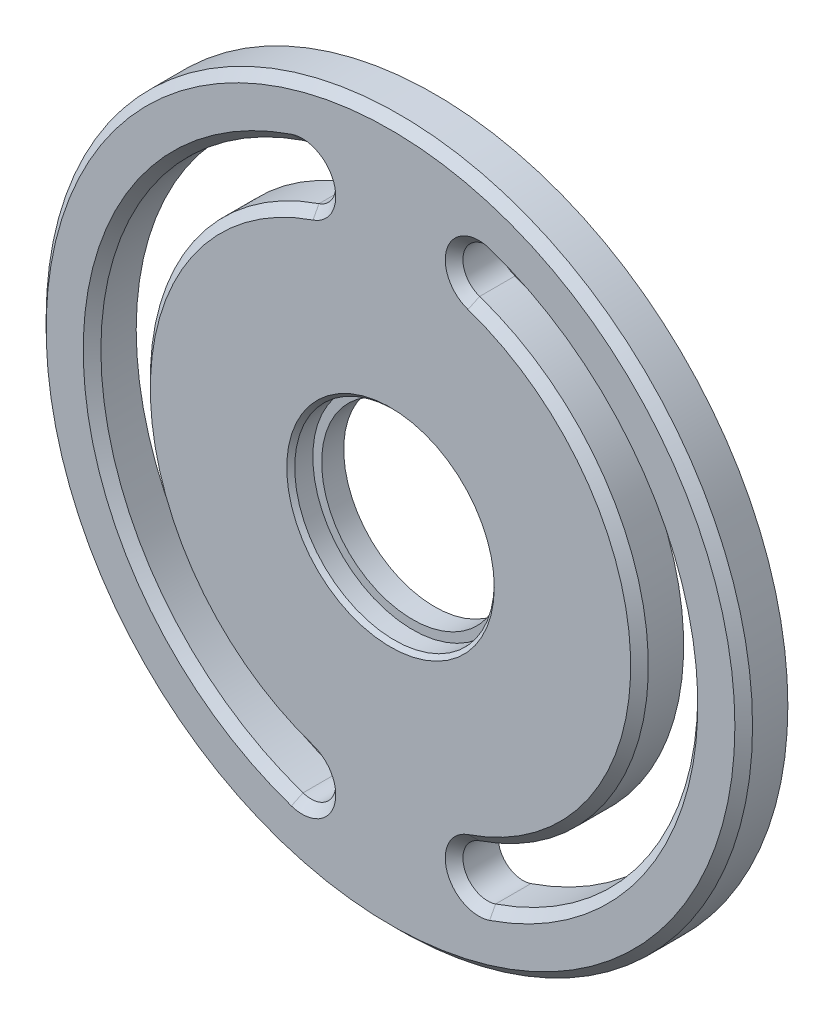
ISO-10303-21;
HEADER;
FILE_DESCRIPTION(('STEP AP214'),'2;1');
FILE_NAME('part.step','',(''),(''),'','','');
FILE_SCHEMA(('AUTOMOTIVE_DESIGN { 1 0 10303 214 1 1 1 1 }'));
ENDSEC;
DATA;
#1=APPLICATION_CONTEXT('core data for automotive mechanical design processes');
#2=APPLICATION_PROTOCOL_DEFINITION('international standard','automotive_design',2000,#1);
#3=PRODUCT_CONTEXT('',#1,'mechanical');
#4=PRODUCT('Part','Part','',(#3));
#5=PRODUCT_RELATED_PRODUCT_CATEGORY('part','',(#4));
#6=PRODUCT_DEFINITION_FORMATION('','',#4);
#7=PRODUCT_DEFINITION_CONTEXT('part definition',#1,'design');
#8=PRODUCT_DEFINITION('design','',#6,#7);
#9=PRODUCT_DEFINITION_SHAPE('','',#8);
#10=(LENGTH_UNIT() NAMED_UNIT(*) SI_UNIT(.MILLI.,.METRE.));
#11=(NAMED_UNIT(*) PLANE_ANGLE_UNIT() SI_UNIT($,.RADIAN.));
#12=(NAMED_UNIT(*) SI_UNIT($,.STERADIAN.) SOLID_ANGLE_UNIT());
#13=UNCERTAINTY_MEASURE_WITH_UNIT(LENGTH_MEASURE(1.E-05),#10,'distance_accuracy_value','');
#14=(GEOMETRIC_REPRESENTATION_CONTEXT(3) GLOBAL_UNCERTAINTY_ASSIGNED_CONTEXT((#13)) GLOBAL_UNIT_ASSIGNED_CONTEXT((#10,
#11,#12)) REPRESENTATION_CONTEXT('',''));
#15=CARTESIAN_POINT('',(0.,0.,0.));
#16=DIRECTION('',(0.,0.,1.));
#17=DIRECTION('',(1.,0.,0.));
#18=AXIS2_PLACEMENT_3D('',#15,#16,#17);
#19=CARTESIAN_POINT('',(0.,0.,6.35));
#20=DIRECTION('',(0.,0.,1.));
#21=DIRECTION('',(1.,0.,0.));
#22=AXIS2_PLACEMENT_3D('',#19,#20,#21);
#23=PLANE('',#22);
#24=CARTESIAN_POINT('',(0.,0.,6.35));
#25=DIRECTION('',(0.,0.,1.));
#26=DIRECTION('',(1.,0.,0.));
#27=AXIS2_PLACEMENT_3D('',#24,#25,#26);
#28=CIRCLE('',#27,14.9225);
#29=CARTESIAN_POINT('',(14.9225,0.,6.35));
#30=VERTEX_POINT('',#29);
#31=EDGE_CURVE('E585',#30,#30,#28,.T.);
#32=ORIENTED_EDGE('',*,*,#31,.F.);
#33=EDGE_LOOP('',(#32));
#34=FACE_BOUND('',#33,.T.);
#35=CARTESIAN_POINT('',(0.,0.,6.35));
#36=DIRECTION('',(0.,0.,1.));
#37=DIRECTION('',(1.,0.,0.));
#38=AXIS2_PLACEMENT_3D('',#35,#36,#37);
#39=CIRCLE('',#38,44.196);
#40=CARTESIAN_POINT('',(14.2567741935484,41.8333695223583,6.35));
#41=VERTEX_POINT('',#40);
#42=CARTESIAN_POINT('',(14.2567741935484,-41.8333695223583,6.35));
#43=VERTEX_POINT('',#42);
#44=EDGE_CURVE('E219',#41,#43,#39,.F.);
#45=ORIENTED_EDGE('',*,*,#44,.T.);
#46=CARTESIAN_POINT('',(12.7,-37.2653579078479,6.35));
#47=DIRECTION('',(0.,0.,1.));
#48=DIRECTION('',(1.,0.,0.));
#49=AXIS2_PLACEMENT_3D('',#46,#47,#48);
#50=CIRCLE('',#49,4.82600000000001);
#51=CARTESIAN_POINT('',(11.1432258064516,-32.6973462933375,6.35));
#52=VERTEX_POINT('',#51);
#53=EDGE_CURVE('E221',#43,#52,#50,.F.);
#54=ORIENTED_EDGE('',*,*,#53,.T.);
#55=CARTESIAN_POINT('',(0.,0.,6.35));
#56=DIRECTION('',(0.,0.,1.));
#57=DIRECTION('',(1.,0.,0.));
#58=AXIS2_PLACEMENT_3D('',#55,#56,#57);
#59=CIRCLE('',#58,34.544);
#60=CARTESIAN_POINT('',(11.1432258064516,32.6973462933375,6.35));
#61=VERTEX_POINT('',#60);
#62=EDGE_CURVE('E215',#52,#61,#59,.T.);
#63=ORIENTED_EDGE('',*,*,#62,.T.);
#64=CARTESIAN_POINT('',(12.7,37.2653579078479,6.35));
#65=DIRECTION('',(0.,0.,1.));
#66=DIRECTION('',(1.,0.,0.));
#67=AXIS2_PLACEMENT_3D('',#64,#65,#66);
#68=CIRCLE('',#67,4.82600000000001);
#69=EDGE_CURVE('E217',#61,#41,#68,.F.);
#70=ORIENTED_EDGE('',*,*,#69,.T.);
#71=EDGE_LOOP('',(#45,#54,#63,#70));
#72=FACE_BOUND('',#71,.T.);
#73=CARTESIAN_POINT('',(0.,0.,6.35));
#74=DIRECTION('',(0.,0.,1.));
#75=DIRECTION('',(1.,0.,0.));
#76=AXIS2_PLACEMENT_3D('',#73,#74,#75);
#77=CIRCLE('',#76,34.544);
#78=CARTESIAN_POINT('',(-11.1432258064516,32.6973462933375,6.35));
#79=VERTEX_POINT('',#78);
#80=CARTESIAN_POINT('',(-11.1432258064516,-32.6973462933375,6.35));
#81=VERTEX_POINT('',#80);
#82=EDGE_CURVE('E210',#79,#81,#77,.T.);
#83=ORIENTED_EDGE('',*,*,#82,.T.);
#84=CARTESIAN_POINT('',(-12.7,-37.2653579078479,6.35));
#85=DIRECTION('',(0.,0.,1.));
#86=DIRECTION('',(1.,0.,0.));
#87=AXIS2_PLACEMENT_3D('',#84,#85,#86);
#88=CIRCLE('',#87,4.82600000000003);
#89=CARTESIAN_POINT('',(-14.2567741935484,-41.8333695223583,6.35));
#90=VERTEX_POINT('',#89);
#91=EDGE_CURVE('E212',#81,#90,#88,.F.);
#92=ORIENTED_EDGE('',*,*,#91,.T.);
#93=CARTESIAN_POINT('',(0.,0.,6.35));
#94=DIRECTION('',(0.,0.,1.));
#95=DIRECTION('',(1.,0.,0.));
#96=AXIS2_PLACEMENT_3D('',#93,#94,#95);
#97=CIRCLE('',#96,44.196);
#98=CARTESIAN_POINT('',(-14.2567741935484,41.8333695223583,6.35));
#99=VERTEX_POINT('',#98);
#100=EDGE_CURVE('E206',#90,#99,#97,.F.);
#101=ORIENTED_EDGE('',*,*,#100,.T.);
#102=CARTESIAN_POINT('',(-12.7,37.2653579078479,6.35));
#103=DIRECTION('',(0.,0.,1.));
#104=DIRECTION('',(1.,0.,0.));
#105=AXIS2_PLACEMENT_3D('',#102,#103,#104);
#106=CIRCLE('',#105,4.82600000000002);
#107=EDGE_CURVE('E208',#99,#79,#106,.F.);
#108=ORIENTED_EDGE('',*,*,#107,.T.);
#109=EDGE_LOOP('',(#83,#92,#101,#108));
#110=FACE_BOUND('',#109,.T.);
#111=CARTESIAN_POINT('',(0.,0.,6.35));
#112=DIRECTION('',(0.,0.,1.));
#113=DIRECTION('',(1.,0.,0.));
#114=AXIS2_PLACEMENT_3D('',#111,#112,#113);
#115=CIRCLE('',#114,49.53);
#116=CARTESIAN_POINT('',(49.53,0.,6.35));
#117=VERTEX_POINT('',#116);
#118=EDGE_CURVE('E203',#117,#117,#115,.T.);
#119=ORIENTED_EDGE('',*,*,#118,.T.);
#120=EDGE_LOOP('',(#119));
#121=FACE_BOUND('',#120,.T.);
#122=ADVANCED_FACE('F43',(#34,#72,#110,#121),#23,.T.);
#123=CARTESIAN_POINT('',(0.,0.,0.));
#124=DIRECTION('',(0.,0.,1.));
#125=DIRECTION('',(1.,0.,0.));
#126=AXIS2_PLACEMENT_3D('',#123,#124,#125);
#127=PLANE('',#126);
#128=CARTESIAN_POINT('',(0.,0.,0.));
#129=DIRECTION('',(0.,0.,1.));
#130=DIRECTION('',(1.,0.,0.));
#131=AXIS2_PLACEMENT_3D('',#128,#129,#130);
#132=CIRCLE('',#131,13.081);
#133=CARTESIAN_POINT('',(13.081,0.,0.));
#134=VERTEX_POINT('',#133);
#135=EDGE_CURVE('E168',#134,#134,#132,.T.);
#136=ORIENTED_EDGE('',*,*,#135,.T.);
#137=EDGE_LOOP('',(#136));
#138=FACE_BOUND('',#137,.T.);
#139=CARTESIAN_POINT('',(-12.7,37.2653579078479,0.));
#140=DIRECTION('',(0.,0.,1.));
#141=DIRECTION('',(1.,0.,0.));
#142=AXIS2_PLACEMENT_3D('',#139,#140,#141);
#143=CIRCLE('',#142,3.556);
#144=CARTESIAN_POINT('',(-11.5529032258064,33.8994546129455,0.));
#145=VERTEX_POINT('',#144);
#146=CARTESIAN_POINT('',(-13.8470967741935,40.6312612027503,0.));
#147=VERTEX_POINT('',#146);
#148=EDGE_CURVE('E147',#145,#147,#143,.T.);
#149=ORIENTED_EDGE('',*,*,#148,.T.);
#150=CARTESIAN_POINT('',(0.,0.,0.));
#151=DIRECTION('',(0.,0.,1.));
#152=DIRECTION('',(1.,0.,0.));
#153=AXIS2_PLACEMENT_3D('',#150,#151,#152);
#154=CIRCLE('',#153,42.926);
#155=CARTESIAN_POINT('',(-13.8470967741936,-40.6312612027503,0.));
#156=VERTEX_POINT('',#155);
#157=EDGE_CURVE('E180',#147,#156,#154,.T.);
#158=ORIENTED_EDGE('',*,*,#157,.T.);
#159=CARTESIAN_POINT('',(-12.7,-37.2653579078479,0.));
#160=DIRECTION('',(0.,0.,1.));
#161=DIRECTION('',(1.,0.,0.));
#162=AXIS2_PLACEMENT_3D('',#159,#160,#161);
#163=CIRCLE('',#162,3.556);
#164=CARTESIAN_POINT('',(-11.5529032258064,-33.8994546129455,0.));
#165=VERTEX_POINT('',#164);
#166=EDGE_CURVE('E183',#156,#165,#163,.T.);
#167=ORIENTED_EDGE('',*,*,#166,.T.);
#168=CARTESIAN_POINT('',(0.,0.,0.));
#169=DIRECTION('',(0.,0.,-1.));
#170=DIRECTION('',(1.,0.,0.));
#171=AXIS2_PLACEMENT_3D('',#168,#169,#170);
#172=CIRCLE('',#171,35.814);
#173=EDGE_CURVE('E186',#165,#145,#172,.T.);
#174=ORIENTED_EDGE('',*,*,#173,.T.);
#175=EDGE_LOOP('',(#149,#158,#167,#174));
#176=FACE_BOUND('',#175,.T.);
#177=CARTESIAN_POINT('',(0.,0.,0.));
#178=DIRECTION('',(0.,0.,1.));
#179=DIRECTION('',(1.,0.,0.));
#180=AXIS2_PLACEMENT_3D('',#177,#178,#179);
#181=CIRCLE('',#180,50.8);
#182=CARTESIAN_POINT('',(50.8,0.,0.));
#183=VERTEX_POINT('',#182);
#184=EDGE_CURVE('E197',#183,#183,#181,.T.);
#185=ORIENTED_EDGE('',*,*,#184,.F.);
#186=EDGE_LOOP('',(#185));
#187=FACE_BOUND('',#186,.T.);
#188=CARTESIAN_POINT('',(12.7,37.2653579078479,0.));
#189=DIRECTION('',(0.,0.,1.));
#190=DIRECTION('',(-1.,0.,0.));
#191=AXIS2_PLACEMENT_3D('',#188,#189,#190);
#192=CIRCLE('',#191,3.556);
#193=CARTESIAN_POINT('',(13.8470967741935,40.6312612027503,0.));
#194=VERTEX_POINT('',#193);
#195=CARTESIAN_POINT('',(11.5529032258064,33.8994546129455,0.));
#196=VERTEX_POINT('',#195);
#197=EDGE_CURVE('E141',#194,#196,#192,.T.);
#198=ORIENTED_EDGE('',*,*,#197,.T.);
#199=CARTESIAN_POINT('',(0.,0.,0.));
#200=DIRECTION('',(0.,0.,-1.));
#201=DIRECTION('',(-1.,0.,0.));
#202=AXIS2_PLACEMENT_3D('',#199,#200,#201);
#203=CIRCLE('',#202,35.814);
#204=CARTESIAN_POINT('',(11.5529032258064,-33.8994546129455,0.));
#205=VERTEX_POINT('',#204);
#206=EDGE_CURVE('E151',#196,#205,#203,.T.);
#207=ORIENTED_EDGE('',*,*,#206,.T.);
#208=CARTESIAN_POINT('',(12.7,-37.2653579078479,0.));
#209=DIRECTION('',(0.,0.,1.));
#210=DIRECTION('',(-1.,0.,0.));
#211=AXIS2_PLACEMENT_3D('',#208,#209,#210);
#212=CIRCLE('',#211,3.556);
#213=CARTESIAN_POINT('',(13.8470967741936,-40.6312612027503,0.));
#214=VERTEX_POINT('',#213);
#215=EDGE_CURVE('E157',#205,#214,#212,.T.);
#216=ORIENTED_EDGE('',*,*,#215,.T.);
#217=CARTESIAN_POINT('',(0.,0.,0.));
#218=DIRECTION('',(0.,0.,1.));
#219=DIRECTION('',(-1.,0.,0.));
#220=AXIS2_PLACEMENT_3D('',#217,#218,#219);
#221=CIRCLE('',#220,42.926);
#222=EDGE_CURVE('E161',#214,#194,#221,.T.);
#223=ORIENTED_EDGE('',*,*,#222,.T.);
#224=EDGE_LOOP('',(#198,#207,#216,#223));
#225=FACE_BOUND('',#224,.T.);
#226=ADVANCED_FACE('F159',(#138,#176,#187,#225),#127,.F.);
#227=CARTESIAN_POINT('',(0.,0.,6.35));
#228=DIRECTION('',(0.,0.,-1.));
#229=DIRECTION('',(-1.,0.,0.));
#230=AXIS2_PLACEMENT_3D('',#227,#228,#229);
#231=CYLINDRICAL_SURFACE('',#230,50.8);
#232=CARTESIAN_POINT('',(0.,0.,5.07999999999999));
#233=DIRECTION('',(0.,0.,1.));
#234=DIRECTION('',(1.,0.,0.));
#235=AXIS2_PLACEMENT_3D('',#232,#233,#234);
#236=CIRCLE('',#235,50.8);
#237=CARTESIAN_POINT('',(50.8,0.,5.07999999999999));
#238=VERTEX_POINT('',#237);
#239=EDGE_CURVE('E11',#238,#238,#236,.F.);
#240=ORIENTED_EDGE('',*,*,#239,.T.);
#241=EDGE_LOOP('',(#240));
#242=FACE_BOUND('',#241,.T.);
#243=ORIENTED_EDGE('',*,*,#184,.T.);
#244=EDGE_LOOP('',(#243));
#245=FACE_BOUND('',#244,.T.);
#246=ADVANCED_FACE('F281',(#242,#245),#231,.T.);
#247=CARTESIAN_POINT('',(-12.7,37.2653579078479,6.35));
#248=DIRECTION('',(0.,0.,-1.));
#249=DIRECTION('',(-1.,0.,0.));
#250=AXIS2_PLACEMENT_3D('',#247,#248,#249);
#251=CYLINDRICAL_SURFACE('',#250,3.556);
#252=DIRECTION('',(0.,0.,-1.));
#253=VECTOR('',#252,1.);
#254=CARTESIAN_POINT('',(-11.5529032258064,33.8994546129455,6.35));
#255=LINE('',#254,#253);
#256=CARTESIAN_POINT('',(-11.5529032258064,33.8994546129455,5.08000000000001));
#257=VERTEX_POINT('',#256);
#258=EDGE_CURVE('E189',#257,#145,#255,.T.);
#259=ORIENTED_EDGE('',*,*,#258,.F.);
#260=CARTESIAN_POINT('',(-12.7,37.2653579078479,5.08000000000001));
#261=DIRECTION('',(0.,0.,1.));
#262=DIRECTION('',(1.,0.,0.));
#263=AXIS2_PLACEMENT_3D('',#260,#261,#262);
#264=CIRCLE('',#263,3.556);
#265=CARTESIAN_POINT('',(-13.8470967741935,40.6312612027503,5.08000000000001));
#266=VERTEX_POINT('',#265);
#267=EDGE_CURVE('E61',#257,#266,#264,.T.);
#268=ORIENTED_EDGE('',*,*,#267,.T.);
#269=DIRECTION('',(0.,0.,-1.));
#270=VECTOR('',#269,1.);
#271=CARTESIAN_POINT('',(-13.8470967741935,40.6312612027503,6.35));
#272=LINE('',#271,#270);
#273=EDGE_CURVE('E195',#266,#147,#272,.T.);
#274=ORIENTED_EDGE('',*,*,#273,.T.);
#275=ORIENTED_EDGE('',*,*,#148,.F.);
#276=EDGE_LOOP('',(#259,#268,#274,#275));
#277=FACE_BOUND('',#276,.T.);
#278=ADVANCED_FACE('F279',(#277),#251,.F.);
#279=CARTESIAN_POINT('',(0.,0.,6.35));
#280=DIRECTION('',(0.,0.,-1.));
#281=DIRECTION('',(-1.,0.,0.));
#282=AXIS2_PLACEMENT_3D('',#279,#280,#281);
#283=CYLINDRICAL_SURFACE('',#282,42.926);
#284=ORIENTED_EDGE('',*,*,#273,.F.);
#285=CARTESIAN_POINT('',(0.,0.,5.08000000000001));
#286=DIRECTION('',(0.,0.,1.));
#287=DIRECTION('',(1.,0.,0.));
#288=AXIS2_PLACEMENT_3D('',#285,#286,#287);
#289=CIRCLE('',#288,42.926);
#290=CARTESIAN_POINT('',(-13.8470967741936,-40.6312612027503,5.08000000000001));
#291=VERTEX_POINT('',#290);
#292=EDGE_CURVE('E53',#266,#291,#289,.T.);
#293=ORIENTED_EDGE('',*,*,#292,.T.);
#294=DIRECTION('',(0.,0.,-1.));
#295=VECTOR('',#294,1.);
#296=CARTESIAN_POINT('',(-13.8470967741936,-40.6312612027503,6.35));
#297=LINE('',#296,#295);
#298=EDGE_CURVE('E193',#291,#156,#297,.T.);
#299=ORIENTED_EDGE('',*,*,#298,.T.);
#300=ORIENTED_EDGE('',*,*,#157,.F.);
#301=EDGE_LOOP('',(#284,#293,#299,#300));
#302=FACE_BOUND('',#301,.T.);
#303=ADVANCED_FACE('F278',(#302),#283,.F.);
#304=CARTESIAN_POINT('',(-12.7,-37.2653579078479,6.35));
#305=DIRECTION('',(0.,0.,-1.));
#306=DIRECTION('',(-1.,0.,0.));
#307=AXIS2_PLACEMENT_3D('',#304,#305,#306);
#308=CYLINDRICAL_SURFACE('',#307,3.556);
#309=ORIENTED_EDGE('',*,*,#298,.F.);
#310=CARTESIAN_POINT('',(-12.7,-37.2653579078479,5.08000000000001));
#311=DIRECTION('',(0.,0.,1.));
#312=DIRECTION('',(1.,0.,0.));
#313=AXIS2_PLACEMENT_3D('',#310,#311,#312);
#314=CIRCLE('',#313,3.556);
#315=CARTESIAN_POINT('',(-11.5529032258064,-33.8994546129455,5.08000000000001));
#316=VERTEX_POINT('',#315);
#317=EDGE_CURVE('E229',#291,#316,#314,.T.);
#318=ORIENTED_EDGE('',*,*,#317,.T.);
#319=DIRECTION('',(0.,0.,-1.));
#320=VECTOR('',#319,1.);
#321=CARTESIAN_POINT('',(-11.5529032258064,-33.8994546129455,6.35));
#322=LINE('',#321,#320);
#323=EDGE_CURVE('E191',#316,#165,#322,.T.);
#324=ORIENTED_EDGE('',*,*,#323,.T.);
#325=ORIENTED_EDGE('',*,*,#166,.F.);
#326=EDGE_LOOP('',(#309,#318,#324,#325));
#327=FACE_BOUND('',#326,.T.);
#328=ADVANCED_FACE('F269',(#327),#308,.F.);
#329=CARTESIAN_POINT('',(0.,0.,6.35));
#330=DIRECTION('',(0.,0.,-1.));
#331=DIRECTION('',(-1.,0.,0.));
#332=AXIS2_PLACEMENT_3D('',#329,#330,#331);
#333=CYLINDRICAL_SURFACE('',#332,35.814);
#334=ORIENTED_EDGE('',*,*,#323,.F.);
#335=CARTESIAN_POINT('',(0.,0.,5.08000000000001));
#336=DIRECTION('',(0.,0.,1.));
#337=DIRECTION('',(1.,0.,0.));
#338=AXIS2_PLACEMENT_3D('',#335,#336,#337);
#339=CIRCLE('',#338,35.814);
#340=EDGE_CURVE('E69',#316,#257,#339,.F.);
#341=ORIENTED_EDGE('',*,*,#340,.T.);
#342=ORIENTED_EDGE('',*,*,#258,.T.);
#343=ORIENTED_EDGE('',*,*,#173,.F.);
#344=EDGE_LOOP('',(#334,#341,#342,#343));
#345=FACE_BOUND('',#344,.T.);
#346=ADVANCED_FACE('F272',(#345),#333,.T.);
#347=CARTESIAN_POINT('',(12.7,37.2653579078479,6.35));
#348=DIRECTION('',(0.,0.,-1.));
#349=DIRECTION('',(-1.,0.,0.));
#350=AXIS2_PLACEMENT_3D('',#347,#348,#349);
#351=CYLINDRICAL_SURFACE('',#350,3.556);
#352=DIRECTION('',(0.,0.,-1.));
#353=VECTOR('',#352,1.);
#354=CARTESIAN_POINT('',(13.8470967741935,40.6312612027503,6.35));
#355=LINE('',#354,#353);
#356=CARTESIAN_POINT('',(13.8470967741935,40.6312612027503,5.08));
#357=VERTEX_POINT('',#356);
#358=EDGE_CURVE('E173',#357,#194,#355,.T.);
#359=ORIENTED_EDGE('',*,*,#358,.F.);
#360=CARTESIAN_POINT('',(12.7,37.2653579078479,5.08));
#361=DIRECTION('',(0.,0.,1.));
#362=DIRECTION('',(1.,0.,0.));
#363=AXIS2_PLACEMENT_3D('',#360,#361,#362);
#364=CIRCLE('',#363,3.556);
#365=CARTESIAN_POINT('',(11.5529032258064,33.8994546129455,5.08));
#366=VERTEX_POINT('',#365);
#367=EDGE_CURVE('E144',#357,#366,#364,.T.);
#368=ORIENTED_EDGE('',*,*,#367,.T.);
#369=DIRECTION('',(0.,0.,-1.));
#370=VECTOR('',#369,1.);
#371=CARTESIAN_POINT('',(11.5529032258064,33.8994546129455,6.35));
#372=LINE('',#371,#370);
#373=EDGE_CURVE('E136',#366,#196,#372,.T.);
#374=ORIENTED_EDGE('',*,*,#373,.T.);
#375=ORIENTED_EDGE('',*,*,#197,.F.);
#376=EDGE_LOOP('',(#359,#368,#374,#375));
#377=FACE_BOUND('',#376,.T.);
#378=ADVANCED_FACE('F139',(#377),#351,.F.);
#379=CARTESIAN_POINT('',(0.,0.,6.35));
#380=DIRECTION('',(0.,0.,-1.));
#381=DIRECTION('',(-1.,0.,0.));
#382=AXIS2_PLACEMENT_3D('',#379,#380,#381);
#383=CYLINDRICAL_SURFACE('',#382,35.814);
#384=ORIENTED_EDGE('',*,*,#373,.F.);
#385=CARTESIAN_POINT('',(0.,0.,5.08));
#386=DIRECTION('',(0.,0.,1.));
#387=DIRECTION('',(1.,0.,0.));
#388=AXIS2_PLACEMENT_3D('',#385,#386,#387);
#389=CIRCLE('',#388,35.814);
#390=CARTESIAN_POINT('',(11.5529032258064,-33.8994546129455,5.08));
#391=VERTEX_POINT('',#390);
#392=EDGE_CURVE('E227',#366,#391,#389,.F.);
#393=ORIENTED_EDGE('',*,*,#392,.T.);
#394=DIRECTION('',(0.,0.,-1.));
#395=VECTOR('',#394,1.);
#396=CARTESIAN_POINT('',(11.5529032258064,-33.8994546129455,6.35));
#397=LINE('',#396,#395);
#398=EDGE_CURVE('E148',#391,#205,#397,.T.);
#399=ORIENTED_EDGE('',*,*,#398,.T.);
#400=ORIENTED_EDGE('',*,*,#206,.F.);
#401=EDGE_LOOP('',(#384,#393,#399,#400));
#402=FACE_BOUND('',#401,.T.);
#403=ADVANCED_FACE('F152',(#402),#383,.T.);
#404=CARTESIAN_POINT('',(12.7,-37.2653579078479,6.35));
#405=DIRECTION('',(0.,0.,-1.));
#406=DIRECTION('',(-1.,0.,0.));
#407=AXIS2_PLACEMENT_3D('',#404,#405,#406);
#408=CYLINDRICAL_SURFACE('',#407,3.556);
#409=ORIENTED_EDGE('',*,*,#398,.F.);
#410=CARTESIAN_POINT('',(12.7,-37.2653579078479,5.08));
#411=DIRECTION('',(0.,0.,1.));
#412=DIRECTION('',(1.,0.,0.));
#413=AXIS2_PLACEMENT_3D('',#410,#411,#412);
#414=CIRCLE('',#413,3.556);
#415=CARTESIAN_POINT('',(13.8470967741936,-40.6312612027503,5.08));
#416=VERTEX_POINT('',#415);
#417=EDGE_CURVE('E200',#391,#416,#414,.T.);
#418=ORIENTED_EDGE('',*,*,#417,.T.);
#419=DIRECTION('',(0.,0.,-1.));
#420=VECTOR('',#419,1.);
#421=CARTESIAN_POINT('',(13.8470967741936,-40.6312612027503,6.35));
#422=LINE('',#421,#420);
#423=EDGE_CURVE('E175',#416,#214,#422,.T.);
#424=ORIENTED_EDGE('',*,*,#423,.T.);
#425=ORIENTED_EDGE('',*,*,#215,.F.);
#426=EDGE_LOOP('',(#409,#418,#424,#425));
#427=FACE_BOUND('',#426,.T.);
#428=ADVANCED_FACE('F475',(#427),#408,.F.);
#429=CARTESIAN_POINT('',(0.,0.,6.35));
#430=DIRECTION('',(0.,0.,-1.));
#431=DIRECTION('',(-1.,0.,0.));
#432=AXIS2_PLACEMENT_3D('',#429,#430,#431);
#433=CYLINDRICAL_SURFACE('',#432,42.926);
#434=ORIENTED_EDGE('',*,*,#423,.F.);
#435=CARTESIAN_POINT('',(0.,0.,5.08));
#436=DIRECTION('',(0.,0.,1.));
#437=DIRECTION('',(1.,0.,0.));
#438=AXIS2_PLACEMENT_3D('',#435,#436,#437);
#439=CIRCLE('',#438,42.926);
#440=EDGE_CURVE('E224',#416,#357,#439,.T.);
#441=ORIENTED_EDGE('',*,*,#440,.T.);
#442=ORIENTED_EDGE('',*,*,#358,.T.);
#443=ORIENTED_EDGE('',*,*,#222,.F.);
#444=EDGE_LOOP('',(#434,#441,#442,#443));
#445=FACE_BOUND('',#444,.T.);
#446=ADVANCED_FACE('F329',(#445),#433,.F.);
#447=CARTESIAN_POINT('',(12.7,37.2653579078479,5.08));
#448=DIRECTION('',(0.,0.,1.));
#449=DIRECTION('',(1.,0.,0.));
#450=AXIS2_PLACEMENT_3D('',#447,#448,#449);
#451=CONICAL_SURFACE('',#450,3.556,0.785398163397453);
#452=DIRECTION('',(-0.228098961673081,-0.669306255524081,-0.707106781186544));
#453=VECTOR('',#452,1.);
#454=CARTESIAN_POINT('',(14.2567741935484,41.8333695223583,6.35));
#455=LINE('',#454,#453);
#456=EDGE_CURVE('E165',#41,#357,#455,.T.);
#457=ORIENTED_EDGE('',*,*,#456,.F.);
#458=ORIENTED_EDGE('',*,*,#69,.F.);
#459=DIRECTION('',(-0.228098961673081,-0.669306255524081,0.707106781186544));
#460=VECTOR('',#459,1.);
#461=CARTESIAN_POINT('',(11.5529032258064,33.8994546129455,5.08));
#462=LINE('',#461,#460);
#463=EDGE_CURVE('E162',#366,#61,#462,.T.);
#464=ORIENTED_EDGE('',*,*,#463,.F.);
#465=ORIENTED_EDGE('',*,*,#367,.F.);
#466=EDGE_LOOP('',(#457,#458,#464,#465));
#467=FACE_BOUND('',#466,.T.);
#468=ADVANCED_FACE('F323',(#467),#451,.F.);
#469=CARTESIAN_POINT('',(0.,0.,5.08));
#470=DIRECTION('',(0.,0.,-1.));
#471=DIRECTION('',(-1.,0.,0.));
#472=AXIS2_PLACEMENT_3D('',#469,#470,#471);
#473=CONICAL_SURFACE('',#472,35.814,0.785398163397454);
#474=ORIENTED_EDGE('',*,*,#463,.T.);
#475=ORIENTED_EDGE('',*,*,#62,.F.);
#476=DIRECTION('',(-0.228098961673081,0.669306255524081,0.707106781186544));
#477=VECTOR('',#476,1.);
#478=CARTESIAN_POINT('',(11.5529032258064,-33.8994546129455,5.08));
#479=LINE('',#478,#477);
#480=EDGE_CURVE('E237',#391,#52,#479,.T.);
#481=ORIENTED_EDGE('',*,*,#480,.F.);
#482=ORIENTED_EDGE('',*,*,#392,.F.);
#483=EDGE_LOOP('',(#474,#475,#481,#482));
#484=FACE_BOUND('',#483,.T.);
#485=ADVANCED_FACE('F316',(#484),#473,.T.);
#486=CARTESIAN_POINT('',(0.,0.,5.08));
#487=DIRECTION('',(0.,0.,1.));
#488=DIRECTION('',(1.,0.,0.));
#489=AXIS2_PLACEMENT_3D('',#486,#487,#488);
#490=CONICAL_SURFACE('',#489,42.926,0.785398163397454);
#491=ORIENTED_EDGE('',*,*,#456,.T.);
#492=ORIENTED_EDGE('',*,*,#440,.F.);
#493=DIRECTION('',(-0.228098961673083,0.669306255524081,-0.707106781186544));
#494=VECTOR('',#493,1.);
#495=CARTESIAN_POINT('',(14.2567741935484,-41.8333695223583,6.35));
#496=LINE('',#495,#494);
#497=EDGE_CURVE('E235',#43,#416,#496,.T.);
#498=ORIENTED_EDGE('',*,*,#497,.F.);
#499=ORIENTED_EDGE('',*,*,#44,.F.);
#500=EDGE_LOOP('',(#491,#492,#498,#499));
#501=FACE_BOUND('',#500,.T.);
#502=ADVANCED_FACE('F309',(#501),#490,.F.);
#503=CARTESIAN_POINT('',(12.7,-37.2653579078479,5.08));
#504=DIRECTION('',(0.,0.,1.));
#505=DIRECTION('',(1.,0.,0.));
#506=AXIS2_PLACEMENT_3D('',#503,#504,#505);
#507=CONICAL_SURFACE('',#506,3.556,0.785398163397453);
#508=ORIENTED_EDGE('',*,*,#480,.T.);
#509=ORIENTED_EDGE('',*,*,#53,.F.);
#510=ORIENTED_EDGE('',*,*,#497,.T.);
#511=ORIENTED_EDGE('',*,*,#417,.F.);
#512=EDGE_LOOP('',(#508,#509,#510,#511));
#513=FACE_BOUND('',#512,.T.);
#514=ADVANCED_FACE('F302',(#513),#507,.F.);
#515=CARTESIAN_POINT('',(-12.7,37.2653579078479,5.08000000000001));
#516=DIRECTION('',(0.,0.,1.));
#517=DIRECTION('',(1.,0.,0.));
#518=AXIS2_PLACEMENT_3D('',#515,#516,#517);
#519=CONICAL_SURFACE('',#518,3.556,0.785398163397459);
#520=DIRECTION('',(-0.228098961673082,0.669306255524085,-0.70710678118654));
#521=VECTOR('',#520,1.);
#522=CARTESIAN_POINT('',(-11.1432258064516,32.6973462933375,6.35));
#523=LINE('',#522,#521);
#524=EDGE_CURVE('E244',#79,#257,#523,.T.);
#525=ORIENTED_EDGE('',*,*,#524,.F.);
#526=ORIENTED_EDGE('',*,*,#107,.F.);
#527=DIRECTION('',(-0.228098961673082,0.669306255524085,0.70710678118654));
#528=VECTOR('',#527,1.);
#529=CARTESIAN_POINT('',(-13.8470967741935,40.6312612027503,5.08000000000001));
#530=LINE('',#529,#528);
#531=EDGE_CURVE('E48',#266,#99,#530,.T.);
#532=ORIENTED_EDGE('',*,*,#531,.F.);
#533=ORIENTED_EDGE('',*,*,#267,.F.);
#534=EDGE_LOOP('',(#525,#526,#532,#533));
#535=FACE_BOUND('',#534,.T.);
#536=ADVANCED_FACE('F258',(#535),#519,.F.);
#537=CARTESIAN_POINT('',(0.,0.,5.08000000000001));
#538=DIRECTION('',(0.,0.,1.));
#539=DIRECTION('',(1.,0.,0.));
#540=AXIS2_PLACEMENT_3D('',#537,#538,#539);
#541=CONICAL_SURFACE('',#540,42.926,0.785398163397459);
#542=ORIENTED_EDGE('',*,*,#531,.T.);
#543=ORIENTED_EDGE('',*,*,#100,.F.);
#544=DIRECTION('',(-0.228098961673084,-0.669306255524085,0.70710678118654));
#545=VECTOR('',#544,1.);
#546=CARTESIAN_POINT('',(-13.8470967741936,-40.6312612027503,5.08000000000001));
#547=LINE('',#546,#545);
#548=EDGE_CURVE('E243',#291,#90,#547,.T.);
#549=ORIENTED_EDGE('',*,*,#548,.F.);
#550=ORIENTED_EDGE('',*,*,#292,.F.);
#551=EDGE_LOOP('',(#542,#543,#549,#550));
#552=FACE_BOUND('',#551,.T.);
#553=ADVANCED_FACE('F254',(#552),#541,.F.);
#554=CARTESIAN_POINT('',(0.,0.,5.08000000000001));
#555=DIRECTION('',(0.,0.,-1.));
#556=DIRECTION('',(-1.,0.,0.));
#557=AXIS2_PLACEMENT_3D('',#554,#555,#556);
#558=CONICAL_SURFACE('',#557,35.814,0.785398163397459);
#559=ORIENTED_EDGE('',*,*,#524,.T.);
#560=ORIENTED_EDGE('',*,*,#340,.F.);
#561=DIRECTION('',(-0.228098961673082,-0.669306255524085,-0.70710678118654));
#562=VECTOR('',#561,1.);
#563=CARTESIAN_POINT('',(-11.1432258064516,-32.6973462933375,6.35));
#564=LINE('',#563,#562);
#565=EDGE_CURVE('E241',#81,#316,#564,.T.);
#566=ORIENTED_EDGE('',*,*,#565,.F.);
#567=ORIENTED_EDGE('',*,*,#82,.F.);
#568=EDGE_LOOP('',(#559,#560,#566,#567));
#569=FACE_BOUND('',#568,.T.);
#570=ADVANCED_FACE('F266',(#569),#558,.T.);
#571=CARTESIAN_POINT('',(-12.7,-37.2653579078479,5.08000000000001));
#572=DIRECTION('',(0.,0.,1.));
#573=DIRECTION('',(1.,0.,0.));
#574=AXIS2_PLACEMENT_3D('',#571,#572,#573);
#575=CONICAL_SURFACE('',#574,3.556,0.78539816339746);
#576=ORIENTED_EDGE('',*,*,#548,.T.);
#577=ORIENTED_EDGE('',*,*,#91,.F.);
#578=ORIENTED_EDGE('',*,*,#565,.T.);
#579=ORIENTED_EDGE('',*,*,#317,.F.);
#580=EDGE_LOOP('',(#576,#577,#578,#579));
#581=FACE_BOUND('',#580,.T.);
#582=ADVANCED_FACE('F264',(#581),#575,.F.);
#583=CARTESIAN_POINT('',(0.,0.,6.35));
#584=DIRECTION('',(0.,0.,-1.));
#585=DIRECTION('',(-1.,0.,0.));
#586=AXIS2_PLACEMENT_3D('',#583,#584,#585);
#587=CONICAL_SURFACE('',#586,49.53,0.78539816339744);
#588=ORIENTED_EDGE('',*,*,#239,.F.);
#589=EDGE_LOOP('',(#588));
#590=FACE_BOUND('',#589,.T.);
#591=ORIENTED_EDGE('',*,*,#118,.F.);
#592=EDGE_LOOP('',(#591));
#593=FACE_BOUND('',#592,.T.);
#594=ADVANCED_FACE('F46',(#590,#593),#587,.T.);
#595=CARTESIAN_POINT('',(0.,0.,6.35));
#596=DIRECTION('',(0.,0.,1.));
#597=DIRECTION('',(1.,0.,0.));
#598=AXIS2_PLACEMENT_3D('',#595,#596,#597);
#599=CYLINDRICAL_SURFACE('',#598,13.081);
#600=ORIENTED_EDGE('',*,*,#135,.F.);
#601=EDGE_LOOP('',(#600));
#602=FACE_BOUND('',#601,.T.);
#603=CARTESIAN_POINT('',(0.,0.,3.175));
#604=DIRECTION('',(0.,0.,1.));
#605=DIRECTION('',(1.,0.,0.));
#606=AXIS2_PLACEMENT_3D('',#603,#604,#605);
#607=CIRCLE('',#606,13.081);
#608=CARTESIAN_POINT('',(13.081,0.,3.175));
#609=VERTEX_POINT('',#608);
#610=EDGE_CURVE('E591',#609,#609,#607,.T.);
#611=ORIENTED_EDGE('',*,*,#610,.T.);
#612=EDGE_LOOP('',(#611));
#613=FACE_BOUND('',#612,.T.);
#614=ADVANCED_FACE('F370',(#602,#613),#599,.F.);
#615=CARTESIAN_POINT('',(14.351,0.,3.175));
#616=DIRECTION('',(0.,0.,-1.));
#617=DIRECTION('',(-1.,0.,0.));
#618=AXIS2_PLACEMENT_3D('',#615,#616,#617);
#619=PLANE('',#618);
#620=ORIENTED_EDGE('',*,*,#610,.F.);
#621=EDGE_LOOP('',(#620));
#622=FACE_BOUND('',#621,.T.);
#623=CARTESIAN_POINT('',(0.,0.,3.175));
#624=DIRECTION('',(0.,0.,1.));
#625=DIRECTION('',(1.,0.,0.));
#626=AXIS2_PLACEMENT_3D('',#623,#624,#625);
#627=CIRCLE('',#626,14.351);
#628=CARTESIAN_POINT('',(14.351,0.,3.175));
#629=VERTEX_POINT('',#628);
#630=EDGE_CURVE('E587',#629,#629,#627,.T.);
#631=ORIENTED_EDGE('',*,*,#630,.T.);
#632=EDGE_LOOP('',(#631));
#633=FACE_BOUND('',#632,.T.);
#634=ADVANCED_FACE('F377',(#622,#633),#619,.F.);
#635=CARTESIAN_POINT('',(0.,0.,6.35));
#636=DIRECTION('',(0.,0.,1.));
#637=DIRECTION('',(1.,0.,0.));
#638=AXIS2_PLACEMENT_3D('',#635,#636,#637);
#639=CYLINDRICAL_SURFACE('',#638,14.351);
#640=ORIENTED_EDGE('',*,*,#630,.F.);
#641=EDGE_LOOP('',(#640));
#642=FACE_BOUND('',#641,.T.);
#643=CARTESIAN_POINT('',(0.,0.,5.7785));
#644=DIRECTION('',(0.,0.,1.));
#645=DIRECTION('',(1.,0.,0.));
#646=AXIS2_PLACEMENT_3D('',#643,#644,#645);
#647=CIRCLE('',#646,14.351);
#648=CARTESIAN_POINT('',(14.351,0.,5.7785));
#649=VERTEX_POINT('',#648);
#650=EDGE_CURVE('E583',#649,#649,#647,.T.);
#651=ORIENTED_EDGE('',*,*,#650,.T.);
#652=EDGE_LOOP('',(#651));
#653=FACE_BOUND('',#652,.T.);
#654=ADVANCED_FACE('F386',(#642,#653),#639,.F.);
#655=CARTESIAN_POINT('',(0.,0.,6.35));
#656=DIRECTION('',(0.,0.,1.));
#657=DIRECTION('',(1.,0.,0.));
#658=AXIS2_PLACEMENT_3D('',#655,#656,#657);
#659=CONICAL_SURFACE('',#658,14.9225,0.785398163397447);
#660=ORIENTED_EDGE('',*,*,#650,.F.);
#661=EDGE_LOOP('',(#660));
#662=FACE_BOUND('',#661,.T.);
#663=ORIENTED_EDGE('',*,*,#31,.T.);
#664=EDGE_LOOP('',(#663));
#665=FACE_BOUND('',#664,.T.);
#666=ADVANCED_FACE('F394',(#662,#665),#659,.F.);
#667=CLOSED_SHELL('',(#122,#226,#246,#278,#303,#328,#346,#378,#403,#428,#446,#468,#485,#502,
#514,#536,#553,#570,#582,#594,#614,#634,#654,#666));
#668=MANIFOLD_SOLID_BREP('B2',#667);
#669=ADVANCED_BREP_SHAPE_REPRESENTATION('',(#18,#668),#14);
#670=SHAPE_DEFINITION_REPRESENTATION(#9,#669);
ENDSEC;
END-ISO-10303-21;
